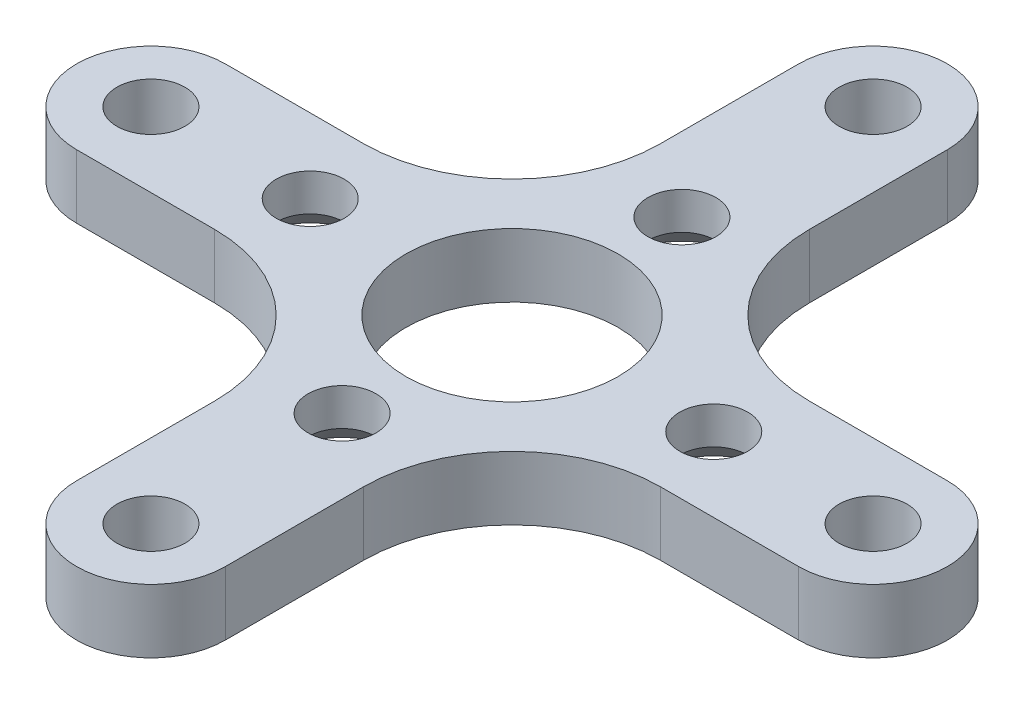
ISO-10303-21;
HEADER;
FILE_DESCRIPTION(('STEP AP214'),'2;1');
FILE_NAME('part.step','',(''),(''),'','','');
FILE_SCHEMA(('AUTOMOTIVE_DESIGN { 1 0 10303 214 1 1 1 1 }'));
ENDSEC;
DATA;
#1=APPLICATION_CONTEXT('core data for automotive mechanical design processes');
#2=APPLICATION_PROTOCOL_DEFINITION('international standard','automotive_design',2000,#1);
#3=PRODUCT_CONTEXT('',#1,'mechanical');
#4=PRODUCT('Part','Part','',(#3));
#5=PRODUCT_RELATED_PRODUCT_CATEGORY('part','',(#4));
#6=PRODUCT_DEFINITION_FORMATION('','',#4);
#7=PRODUCT_DEFINITION_CONTEXT('part definition',#1,'design');
#8=PRODUCT_DEFINITION('design','',#6,#7);
#9=PRODUCT_DEFINITION_SHAPE('','',#8);
#10=(LENGTH_UNIT() NAMED_UNIT(*) SI_UNIT(.MILLI.,.METRE.));
#11=(NAMED_UNIT(*) PLANE_ANGLE_UNIT() SI_UNIT($,.RADIAN.));
#12=(NAMED_UNIT(*) SI_UNIT($,.STERADIAN.) SOLID_ANGLE_UNIT());
#13=UNCERTAINTY_MEASURE_WITH_UNIT(LENGTH_MEASURE(1.E-05),#10,'distance_accuracy_value','');
#14=(GEOMETRIC_REPRESENTATION_CONTEXT(3) GLOBAL_UNCERTAINTY_ASSIGNED_CONTEXT((#13)) GLOBAL_UNIT_ASSIGNED_CONTEXT((#10,
#11,#12)) REPRESENTATION_CONTEXT('',''));
#15=CARTESIAN_POINT('',(0.,0.,0.));
#16=DIRECTION('',(0.,0.,1.));
#17=DIRECTION('',(1.,0.,0.));
#18=AXIS2_PLACEMENT_3D('',#15,#16,#17);
#19=CARTESIAN_POINT('',(0.,0.,0.));
#20=DIRECTION('',(0.,1.,0.));
#21=DIRECTION('',(0.,0.,1.));
#22=AXIS2_PLACEMENT_3D('',#19,#20,#21);
#23=PLANE('',#22);
#24=CARTESIAN_POINT('',(0.,0.,-8.));
#25=DIRECTION('',(0.,-1.,0.));
#26=DIRECTION('',(0.,0.,-1.));
#27=AXIS2_PLACEMENT_3D('',#24,#25,#26);
#28=CIRCLE('',#27,2.85);
#29=CARTESIAN_POINT('',(0.,0.,-10.85));
#30=VERTEX_POINT('',#29);
#31=EDGE_CURVE('E387',#30,#30,#28,.T.);
#32=ORIENTED_EDGE('',*,*,#31,.F.);
#33=EDGE_LOOP('',(#32));
#34=FACE_BOUND('',#33,.T.);
#35=CARTESIAN_POINT('',(-1.04509550507507E-13,0.,8.));
#36=DIRECTION('',(0.,-1.,0.));
#37=DIRECTION('',(0.,0.,-1.));
#38=AXIS2_PLACEMENT_3D('',#35,#36,#37);
#39=CIRCLE('',#38,2.85);
#40=CARTESIAN_POINT('',(-1.04509550507507E-13,0.,5.15));
#41=VERTEX_POINT('',#40);
#42=EDGE_CURVE('E394',#41,#41,#39,.T.);
#43=ORIENTED_EDGE('',*,*,#42,.F.);
#44=EDGE_LOOP('',(#43));
#45=FACE_BOUND('',#44,.T.);
#46=CARTESIAN_POINT('',(-9.5,0.,0.));
#47=DIRECTION('',(0.,-1.,0.));
#48=DIRECTION('',(0.,0.,-1.));
#49=AXIS2_PLACEMENT_3D('',#46,#47,#48);
#50=CIRCLE('',#49,2.85);
#51=CARTESIAN_POINT('',(-9.5,0.,-2.85));
#52=VERTEX_POINT('',#51);
#53=EDGE_CURVE('E403',#52,#52,#50,.T.);
#54=ORIENTED_EDGE('',*,*,#53,.F.);
#55=EDGE_LOOP('',(#54));
#56=FACE_BOUND('',#55,.T.);
#57=CARTESIAN_POINT('',(9.5,0.,0.));
#58=DIRECTION('',(0.,-1.,0.));
#59=DIRECTION('',(0.,0.,-1.));
#60=AXIS2_PLACEMENT_3D('',#57,#58,#59);
#61=CIRCLE('',#60,2.85);
#62=CARTESIAN_POINT('',(9.5,0.,-2.85));
#63=VERTEX_POINT('',#62);
#64=EDGE_CURVE('E412',#63,#63,#61,.T.);
#65=ORIENTED_EDGE('',*,*,#64,.F.);
#66=EDGE_LOOP('',(#65));
#67=FACE_BOUND('',#66,.T.);
#68=CARTESIAN_POINT('',(1.55067111884495E-13,0.,-17.));
#69=DIRECTION('',(0.,-1.,0.));
#70=DIRECTION('',(0.,0.,-1.));
#71=AXIS2_PLACEMENT_3D('',#68,#69,#70);
#72=CIRCLE('',#71,1.59999999999999);
#73=CARTESIAN_POINT('',(1.55067111884495E-13,0.,-18.6));
#74=VERTEX_POINT('',#73);
#75=EDGE_CURVE('E250',#74,#74,#72,.T.);
#76=ORIENTED_EDGE('',*,*,#75,.F.);
#77=EDGE_LOOP('',(#76));
#78=FACE_BOUND('',#77,.T.);
#79=CARTESIAN_POINT('',(-17.,0.,-2.14422294644828E-13));
#80=DIRECTION('',(0.,-1.,0.));
#81=DIRECTION('',(0.,0.,-1.));
#82=AXIS2_PLACEMENT_3D('',#79,#80,#81);
#83=CIRCLE('',#82,1.59999999999999);
#84=CARTESIAN_POINT('',(-17.,0.,-1.6000000000002));
#85=VERTEX_POINT('',#84);
#86=EDGE_CURVE('E249',#85,#85,#83,.T.);
#87=ORIENTED_EDGE('',*,*,#86,.F.);
#88=EDGE_LOOP('',(#87));
#89=FACE_BOUND('',#88,.T.);
#90=CARTESIAN_POINT('',(-1.55067111884495E-13,0.,17.));
#91=DIRECTION('',(0.,-1.,0.));
#92=DIRECTION('',(0.,0.,-1.));
#93=AXIS2_PLACEMENT_3D('',#90,#91,#92);
#94=CIRCLE('',#93,1.59999999999999);
#95=CARTESIAN_POINT('',(-1.55067111884495E-13,0.,15.4));
#96=VERTEX_POINT('',#95);
#97=EDGE_CURVE('E267',#96,#96,#94,.T.);
#98=ORIENTED_EDGE('',*,*,#97,.F.);
#99=EDGE_LOOP('',(#98));
#100=FACE_BOUND('',#99,.T.);
#101=DIRECTION('',(0.,0.,-1.));
#102=VECTOR('',#101,1.);
#103=CARTESIAN_POINT('',(-3.5,0.,0.));
#104=LINE('',#103,#102);
#105=CARTESIAN_POINT('',(-3.5,0.,17.));
#106=VERTEX_POINT('',#105);
#107=CARTESIAN_POINT('',(-3.5,0.,10.5));
#108=VERTEX_POINT('',#107);
#109=EDGE_CURVE('E178',#106,#108,#104,.T.);
#110=ORIENTED_EDGE('',*,*,#109,.T.);
#111=CARTESIAN_POINT('',(-10.5,0.,10.5));
#112=DIRECTION('',(0.,1.,0.));
#113=DIRECTION('',(0.,0.,1.));
#114=AXIS2_PLACEMENT_3D('',#111,#112,#113);
#115=CIRCLE('',#114,7.);
#116=CARTESIAN_POINT('',(-10.5,0.,3.5));
#117=VERTEX_POINT('',#116);
#118=EDGE_CURVE('E214',#108,#117,#115,.T.);
#119=ORIENTED_EDGE('',*,*,#118,.T.);
#120=DIRECTION('',(1.,0.,0.));
#121=VECTOR('',#120,1.);
#122=CARTESIAN_POINT('',(0.,0.,3.5));
#123=LINE('',#122,#121);
#124=CARTESIAN_POINT('',(-17.,0.,3.5));
#125=VERTEX_POINT('',#124);
#126=EDGE_CURVE('E212',#125,#117,#123,.T.);
#127=ORIENTED_EDGE('',*,*,#126,.F.);
#128=CARTESIAN_POINT('',(-17.,0.,0.));
#129=DIRECTION('',(0.,1.,0.));
#130=DIRECTION('',(0.,0.,1.));
#131=AXIS2_PLACEMENT_3D('',#128,#129,#130);
#132=CIRCLE('',#131,3.50000000000002);
#133=CARTESIAN_POINT('',(-17.,0.,-3.5));
#134=VERTEX_POINT('',#133);
#135=EDGE_CURVE('E167',#134,#125,#132,.T.);
#136=ORIENTED_EDGE('',*,*,#135,.F.);
#137=DIRECTION('',(1.,0.,0.));
#138=VECTOR('',#137,1.);
#139=CARTESIAN_POINT('',(0.,0.,-3.5));
#140=LINE('',#139,#138);
#141=CARTESIAN_POINT('',(-10.5,0.,-3.5));
#142=VERTEX_POINT('',#141);
#143=EDGE_CURVE('E208',#134,#142,#140,.T.);
#144=ORIENTED_EDGE('',*,*,#143,.T.);
#145=CARTESIAN_POINT('',(-10.5,0.,-10.5));
#146=DIRECTION('',(0.,1.,0.));
#147=DIRECTION('',(0.,0.,1.));
#148=AXIS2_PLACEMENT_3D('',#145,#146,#147);
#149=CIRCLE('',#148,7.);
#150=CARTESIAN_POINT('',(-3.5,0.,-10.5));
#151=VERTEX_POINT('',#150);
#152=EDGE_CURVE('E205',#151,#142,#149,.F.);
#153=ORIENTED_EDGE('',*,*,#152,.F.);
#154=DIRECTION('',(0.,0.,-1.));
#155=VECTOR('',#154,1.);
#156=CARTESIAN_POINT('',(-3.5,0.,0.));
#157=LINE('',#156,#155);
#158=CARTESIAN_POINT('',(-3.5,0.,-17.));
#159=VERTEX_POINT('',#158);
#160=EDGE_CURVE('E202',#151,#159,#157,.T.);
#161=ORIENTED_EDGE('',*,*,#160,.T.);
#162=CARTESIAN_POINT('',(0.,0.,-17.));
#163=DIRECTION('',(0.,1.,0.));
#164=DIRECTION('',(0.,0.,1.));
#165=AXIS2_PLACEMENT_3D('',#162,#163,#164);
#166=CIRCLE('',#165,3.50000000000002);
#167=CARTESIAN_POINT('',(3.5,0.,-17.));
#168=VERTEX_POINT('',#167);
#169=EDGE_CURVE('E199',#168,#159,#166,.T.);
#170=ORIENTED_EDGE('',*,*,#169,.F.);
#171=DIRECTION('',(0.,0.,-1.));
#172=VECTOR('',#171,1.);
#173=CARTESIAN_POINT('',(3.5,0.,0.));
#174=LINE('',#173,#172);
#175=CARTESIAN_POINT('',(3.5,0.,-10.5000000000001));
#176=VERTEX_POINT('',#175);
#177=EDGE_CURVE('E197',#176,#168,#174,.T.);
#178=ORIENTED_EDGE('',*,*,#177,.F.);
#179=CARTESIAN_POINT('',(10.5,0.,-10.5));
#180=DIRECTION('',(0.,1.,0.));
#181=DIRECTION('',(0.,0.,1.));
#182=AXIS2_PLACEMENT_3D('',#179,#180,#181);
#183=CIRCLE('',#182,7.);
#184=CARTESIAN_POINT('',(10.5000000000001,0.,-3.50000000000001));
#185=VERTEX_POINT('',#184);
#186=EDGE_CURVE('E195',#185,#176,#183,.F.);
#187=ORIENTED_EDGE('',*,*,#186,.F.);
#188=DIRECTION('',(1.,0.,0.));
#189=VECTOR('',#188,1.);
#190=CARTESIAN_POINT('',(0.,0.,-3.5));
#191=LINE('',#190,#189);
#192=CARTESIAN_POINT('',(17.,0.,-3.50000000000001));
#193=VERTEX_POINT('',#192);
#194=EDGE_CURVE('E192',#185,#193,#191,.T.);
#195=ORIENTED_EDGE('',*,*,#194,.T.);
#196=CARTESIAN_POINT('',(17.,0.,1.15587516182841E-13));
#197=DIRECTION('',(0.,1.,0.));
#198=DIRECTION('',(0.,0.,1.));
#199=AXIS2_PLACEMENT_3D('',#196,#197,#198);
#200=CIRCLE('',#199,3.50000000000002);
#201=CARTESIAN_POINT('',(17.,0.,3.49999999999999));
#202=VERTEX_POINT('',#201);
#203=EDGE_CURVE('E189',#202,#193,#200,.T.);
#204=ORIENTED_EDGE('',*,*,#203,.F.);
#205=DIRECTION('',(1.,0.,0.));
#206=VECTOR('',#205,1.);
#207=CARTESIAN_POINT('',(0.,0.,3.49999999999999));
#208=LINE('',#207,#206);
#209=CARTESIAN_POINT('',(10.5000000000001,0.,3.49999999999999));
#210=VERTEX_POINT('',#209);
#211=EDGE_CURVE('E187',#210,#202,#208,.T.);
#212=ORIENTED_EDGE('',*,*,#211,.F.);
#213=CARTESIAN_POINT('',(10.5,0.,10.5));
#214=DIRECTION('',(0.,1.,0.));
#215=DIRECTION('',(0.,0.,1.));
#216=AXIS2_PLACEMENT_3D('',#213,#214,#215);
#217=CIRCLE('',#216,7.);
#218=CARTESIAN_POINT('',(3.5,0.,10.5));
#219=VERTEX_POINT('',#218);
#220=EDGE_CURVE('E185',#219,#210,#217,.F.);
#221=ORIENTED_EDGE('',*,*,#220,.F.);
#222=DIRECTION('',(0.,0.,-1.));
#223=VECTOR('',#222,1.);
#224=CARTESIAN_POINT('',(3.50000000000001,0.,0.));
#225=LINE('',#224,#223);
#226=CARTESIAN_POINT('',(3.5,0.,17.));
#227=VERTEX_POINT('',#226);
#228=EDGE_CURVE('E183',#227,#219,#225,.T.);
#229=ORIENTED_EDGE('',*,*,#228,.F.);
#230=CARTESIAN_POINT('',(-1.74942698943174E-13,0.,17.));
#231=DIRECTION('',(0.,1.,0.));
#232=DIRECTION('',(0.,0.,1.));
#233=AXIS2_PLACEMENT_3D('',#230,#231,#232);
#234=CIRCLE('',#233,3.50000000000002);
#235=EDGE_CURVE('E180',#106,#227,#234,.T.);
#236=ORIENTED_EDGE('',*,*,#235,.F.);
#237=EDGE_LOOP('',(#110,#119,#127,#136,#144,#153,#161,#170,#178,#187,#195,#204,#212,#221,#229,#236));
#238=FACE_BOUND('',#237,.T.);
#239=CARTESIAN_POINT('',(0.,0.,0.));
#240=DIRECTION('',(0.,-1.,0.));
#241=DIRECTION('',(0.,0.,-1.));
#242=AXIS2_PLACEMENT_3D('',#239,#240,#241);
#243=CIRCLE('',#242,4.99999999999999);
#244=CARTESIAN_POINT('',(0.,0.,-4.99999999999999));
#245=VERTEX_POINT('',#244);
#246=EDGE_CURVE('E273',#245,#245,#243,.T.);
#247=ORIENTED_EDGE('',*,*,#246,.F.);
#248=EDGE_LOOP('',(#247));
#249=FACE_BOUND('',#248,.T.);
#250=CARTESIAN_POINT('',(17.,0.,3.33132660165494E-13));
#251=DIRECTION('',(0.,-1.,0.));
#252=DIRECTION('',(0.,0.,-1.));
#253=AXIS2_PLACEMENT_3D('',#250,#251,#252);
#254=CIRCLE('',#253,1.59999999999999);
#255=CARTESIAN_POINT('',(17.,0.,-1.59999999999966));
#256=VERTEX_POINT('',#255);
#257=EDGE_CURVE('E261',#256,#256,#254,.T.);
#258=ORIENTED_EDGE('',*,*,#257,.F.);
#259=EDGE_LOOP('',(#258));
#260=FACE_BOUND('',#259,.T.);
#261=ADVANCED_FACE('F34',(#34,#45,#56,#67,#78,#89,#100,#238,#249,#260),#23,.F.);
#262=CARTESIAN_POINT('',(-3.5,3.,0.));
#263=DIRECTION('',(-1.,0.,0.));
#264=DIRECTION('',(0.,0.,1.));
#265=AXIS2_PLACEMENT_3D('',#262,#263,#264);
#266=PLANE('',#265);
#267=ORIENTED_EDGE('',*,*,#109,.F.);
#268=DIRECTION('',(0.,-1.,0.));
#269=VECTOR('',#268,1.);
#270=CARTESIAN_POINT('',(-3.5,3.,17.));
#271=LINE('',#270,#269);
#272=CARTESIAN_POINT('',(-3.5,3.,17.));
#273=VERTEX_POINT('',#272);
#274=EDGE_CURVE('E11',#273,#106,#271,.T.);
#275=ORIENTED_EDGE('',*,*,#274,.F.);
#276=DIRECTION('',(0.,0.,-1.));
#277=VECTOR('',#276,1.);
#278=CARTESIAN_POINT('',(-3.5,3.,0.));
#279=LINE('',#278,#277);
#280=CARTESIAN_POINT('',(-3.5,3.,10.5));
#281=VERTEX_POINT('',#280);
#282=EDGE_CURVE('E217',#273,#281,#279,.T.);
#283=ORIENTED_EDGE('',*,*,#282,.T.);
#284=DIRECTION('',(0.,-1.,0.));
#285=VECTOR('',#284,1.);
#286=CARTESIAN_POINT('',(-3.5,3.,10.5));
#287=LINE('',#286,#285);
#288=EDGE_CURVE('E53',#281,#108,#287,.T.);
#289=ORIENTED_EDGE('',*,*,#288,.T.);
#290=EDGE_LOOP('',(#267,#275,#283,#289));
#291=FACE_BOUND('',#290,.T.);
#292=ADVANCED_FACE('F36',(#291),#266,.T.);
#293=CARTESIAN_POINT('',(-1.74942698943174E-13,3.,17.));
#294=DIRECTION('',(0.,-1.,0.));
#295=DIRECTION('',(0.,0.,-1.));
#296=AXIS2_PLACEMENT_3D('',#293,#294,#295);
#297=CYLINDRICAL_SURFACE('',#296,3.50000000000002);
#298=ORIENTED_EDGE('',*,*,#235,.T.);
#299=DIRECTION('',(0.,-1.,0.));
#300=VECTOR('',#299,1.);
#301=CARTESIAN_POINT('',(3.5,3.,17.));
#302=LINE('',#301,#300);
#303=CARTESIAN_POINT('',(3.5,3.,17.));
#304=VERTEX_POINT('',#303);
#305=EDGE_CURVE('E44',#304,#227,#302,.T.);
#306=ORIENTED_EDGE('',*,*,#305,.F.);
#307=CARTESIAN_POINT('',(-1.74942698943174E-13,3.,17.));
#308=DIRECTION('',(0.,1.,0.));
#309=DIRECTION('',(0.,0.,1.));
#310=AXIS2_PLACEMENT_3D('',#307,#308,#309);
#311=CIRCLE('',#310,3.50000000000002);
#312=EDGE_CURVE('E279',#273,#304,#311,.T.);
#313=ORIENTED_EDGE('',*,*,#312,.F.);
#314=ORIENTED_EDGE('',*,*,#274,.T.);
#315=EDGE_LOOP('',(#298,#306,#313,#314));
#316=FACE_BOUND('',#315,.T.);
#317=ADVANCED_FACE('F327',(#316),#297,.T.);
#318=CARTESIAN_POINT('',(3.50000000000001,3.,0.));
#319=DIRECTION('',(-1.,0.,0.));
#320=DIRECTION('',(0.,0.,1.));
#321=AXIS2_PLACEMENT_3D('',#318,#319,#320);
#322=PLANE('',#321);
#323=ORIENTED_EDGE('',*,*,#228,.T.);
#324=DIRECTION('',(0.,-1.,0.));
#325=VECTOR('',#324,1.);
#326=CARTESIAN_POINT('',(3.5,3.,10.5));
#327=LINE('',#326,#325);
#328=CARTESIAN_POINT('',(3.5,3.,10.5));
#329=VERTEX_POINT('',#328);
#330=EDGE_CURVE('E243',#329,#219,#327,.T.);
#331=ORIENTED_EDGE('',*,*,#330,.F.);
#332=DIRECTION('',(0.,0.,-1.));
#333=VECTOR('',#332,1.);
#334=CARTESIAN_POINT('',(3.50000000000001,3.,0.));
#335=LINE('',#334,#333);
#336=EDGE_CURVE('E281',#304,#329,#335,.T.);
#337=ORIENTED_EDGE('',*,*,#336,.F.);
#338=ORIENTED_EDGE('',*,*,#305,.T.);
#339=EDGE_LOOP('',(#323,#331,#337,#338));
#340=FACE_BOUND('',#339,.T.);
#341=ADVANCED_FACE('F651',(#340),#322,.F.);
#342=CARTESIAN_POINT('',(10.5,3.,10.5));
#343=DIRECTION('',(0.,-1.,0.));
#344=DIRECTION('',(0.,0.,-1.));
#345=AXIS2_PLACEMENT_3D('',#342,#343,#344);
#346=CYLINDRICAL_SURFACE('',#345,7.);
#347=ORIENTED_EDGE('',*,*,#220,.T.);
#348=DIRECTION('',(0.,-1.,0.));
#349=VECTOR('',#348,1.);
#350=CARTESIAN_POINT('',(10.5000000000001,3.,3.49999999999999));
#351=LINE('',#350,#349);
#352=CARTESIAN_POINT('',(10.5000000000001,3.,3.49999999999999));
#353=VERTEX_POINT('',#352);
#354=EDGE_CURVE('E240',#353,#210,#351,.T.);
#355=ORIENTED_EDGE('',*,*,#354,.F.);
#356=CARTESIAN_POINT('',(10.5,3.,10.5));
#357=DIRECTION('',(0.,1.,0.));
#358=DIRECTION('',(0.,0.,1.));
#359=AXIS2_PLACEMENT_3D('',#356,#357,#358);
#360=CIRCLE('',#359,7.);
#361=EDGE_CURVE('E283',#329,#353,#360,.F.);
#362=ORIENTED_EDGE('',*,*,#361,.F.);
#363=ORIENTED_EDGE('',*,*,#330,.T.);
#364=EDGE_LOOP('',(#347,#355,#362,#363));
#365=FACE_BOUND('',#364,.T.);
#366=ADVANCED_FACE('F642',(#365),#346,.F.);
#367=CARTESIAN_POINT('',(0.,3.,3.49999999999999));
#368=DIRECTION('',(0.,0.,-1.));
#369=DIRECTION('',(-1.,0.,0.));
#370=AXIS2_PLACEMENT_3D('',#367,#368,#369);
#371=PLANE('',#370);
#372=ORIENTED_EDGE('',*,*,#211,.T.);
#373=DIRECTION('',(0.,-1.,0.));
#374=VECTOR('',#373,1.);
#375=CARTESIAN_POINT('',(17.,3.,3.49999999999999));
#376=LINE('',#375,#374);
#377=CARTESIAN_POINT('',(17.,3.,3.49999999999999));
#378=VERTEX_POINT('',#377);
#379=EDGE_CURVE('E237',#378,#202,#376,.T.);
#380=ORIENTED_EDGE('',*,*,#379,.F.);
#381=DIRECTION('',(1.,0.,0.));
#382=VECTOR('',#381,1.);
#383=CARTESIAN_POINT('',(0.,3.,3.49999999999999));
#384=LINE('',#383,#382);
#385=EDGE_CURVE('E285',#353,#378,#384,.T.);
#386=ORIENTED_EDGE('',*,*,#385,.F.);
#387=ORIENTED_EDGE('',*,*,#354,.T.);
#388=EDGE_LOOP('',(#372,#380,#386,#387));
#389=FACE_BOUND('',#388,.T.);
#390=ADVANCED_FACE('F633',(#389),#371,.F.);
#391=CARTESIAN_POINT('',(17.,3.,1.15587516182841E-13));
#392=DIRECTION('',(0.,-1.,0.));
#393=DIRECTION('',(0.,0.,-1.));
#394=AXIS2_PLACEMENT_3D('',#391,#392,#393);
#395=CYLINDRICAL_SURFACE('',#394,3.50000000000002);
#396=ORIENTED_EDGE('',*,*,#203,.T.);
#397=DIRECTION('',(0.,-1.,0.));
#398=VECTOR('',#397,1.);
#399=CARTESIAN_POINT('',(17.,3.,-3.50000000000001));
#400=LINE('',#399,#398);
#401=CARTESIAN_POINT('',(17.,3.,-3.50000000000001));
#402=VERTEX_POINT('',#401);
#403=EDGE_CURVE('E235',#402,#193,#400,.T.);
#404=ORIENTED_EDGE('',*,*,#403,.F.);
#405=CARTESIAN_POINT('',(17.,3.,1.15587516182841E-13));
#406=DIRECTION('',(0.,1.,0.));
#407=DIRECTION('',(0.,0.,1.));
#408=AXIS2_PLACEMENT_3D('',#405,#406,#407);
#409=CIRCLE('',#408,3.50000000000002);
#410=EDGE_CURVE('E287',#378,#402,#409,.T.);
#411=ORIENTED_EDGE('',*,*,#410,.F.);
#412=ORIENTED_EDGE('',*,*,#379,.T.);
#413=EDGE_LOOP('',(#396,#404,#411,#412));
#414=FACE_BOUND('',#413,.T.);
#415=ADVANCED_FACE('F624',(#414),#395,.T.);
#416=CARTESIAN_POINT('',(0.,3.,-3.5));
#417=DIRECTION('',(0.,0.,-1.));
#418=DIRECTION('',(-1.,0.,0.));
#419=AXIS2_PLACEMENT_3D('',#416,#417,#418);
#420=PLANE('',#419);
#421=ORIENTED_EDGE('',*,*,#194,.F.);
#422=DIRECTION('',(0.,-1.,0.));
#423=VECTOR('',#422,1.);
#424=CARTESIAN_POINT('',(10.5000000000001,3.,-3.50000000000001));
#425=LINE('',#424,#423);
#426=CARTESIAN_POINT('',(10.5000000000001,3.,-3.50000000000001));
#427=VERTEX_POINT('',#426);
#428=EDGE_CURVE('E233',#427,#185,#425,.T.);
#429=ORIENTED_EDGE('',*,*,#428,.F.);
#430=DIRECTION('',(1.,0.,0.));
#431=VECTOR('',#430,1.);
#432=CARTESIAN_POINT('',(0.,3.,-3.5));
#433=LINE('',#432,#431);
#434=EDGE_CURVE('E289',#427,#402,#433,.T.);
#435=ORIENTED_EDGE('',*,*,#434,.T.);
#436=ORIENTED_EDGE('',*,*,#403,.T.);
#437=EDGE_LOOP('',(#421,#429,#435,#436));
#438=FACE_BOUND('',#437,.T.);
#439=ADVANCED_FACE('F615',(#438),#420,.T.);
#440=CARTESIAN_POINT('',(10.5,3.,-10.5));
#441=DIRECTION('',(0.,-1.,0.));
#442=DIRECTION('',(0.,0.,-1.));
#443=AXIS2_PLACEMENT_3D('',#440,#441,#442);
#444=CYLINDRICAL_SURFACE('',#443,7.);
#445=ORIENTED_EDGE('',*,*,#186,.T.);
#446=DIRECTION('',(0.,-1.,0.));
#447=VECTOR('',#446,1.);
#448=CARTESIAN_POINT('',(3.5,3.,-10.5000000000001));
#449=LINE('',#448,#447);
#450=CARTESIAN_POINT('',(3.5,3.,-10.5000000000001));
#451=VERTEX_POINT('',#450);
#452=EDGE_CURVE('E230',#451,#176,#449,.T.);
#453=ORIENTED_EDGE('',*,*,#452,.F.);
#454=CARTESIAN_POINT('',(10.5,3.,-10.5));
#455=DIRECTION('',(0.,1.,0.));
#456=DIRECTION('',(0.,0.,1.));
#457=AXIS2_PLACEMENT_3D('',#454,#455,#456);
#458=CIRCLE('',#457,7.);
#459=EDGE_CURVE('E292',#427,#451,#458,.F.);
#460=ORIENTED_EDGE('',*,*,#459,.F.);
#461=ORIENTED_EDGE('',*,*,#428,.T.);
#462=EDGE_LOOP('',(#445,#453,#460,#461));
#463=FACE_BOUND('',#462,.T.);
#464=ADVANCED_FACE('F606',(#463),#444,.F.);
#465=CARTESIAN_POINT('',(3.5,3.,0.));
#466=DIRECTION('',(-1.,0.,0.));
#467=DIRECTION('',(0.,0.,1.));
#468=AXIS2_PLACEMENT_3D('',#465,#466,#467);
#469=PLANE('',#468);
#470=ORIENTED_EDGE('',*,*,#177,.T.);
#471=DIRECTION('',(0.,-1.,0.));
#472=VECTOR('',#471,1.);
#473=CARTESIAN_POINT('',(3.5,3.,-17.));
#474=LINE('',#473,#472);
#475=CARTESIAN_POINT('',(3.5,3.,-17.));
#476=VERTEX_POINT('',#475);
#477=EDGE_CURVE('E227',#476,#168,#474,.T.);
#478=ORIENTED_EDGE('',*,*,#477,.F.);
#479=DIRECTION('',(0.,0.,-1.));
#480=VECTOR('',#479,1.);
#481=CARTESIAN_POINT('',(3.5,3.,0.));
#482=LINE('',#481,#480);
#483=EDGE_CURVE('E294',#451,#476,#482,.T.);
#484=ORIENTED_EDGE('',*,*,#483,.F.);
#485=ORIENTED_EDGE('',*,*,#452,.T.);
#486=EDGE_LOOP('',(#470,#478,#484,#485));
#487=FACE_BOUND('',#486,.T.);
#488=ADVANCED_FACE('F597',(#487),#469,.F.);
#489=CARTESIAN_POINT('',(0.,3.,-17.));
#490=DIRECTION('',(0.,-1.,0.));
#491=DIRECTION('',(0.,0.,-1.));
#492=AXIS2_PLACEMENT_3D('',#489,#490,#491);
#493=CYLINDRICAL_SURFACE('',#492,3.50000000000002);
#494=ORIENTED_EDGE('',*,*,#169,.T.);
#495=DIRECTION('',(0.,-1.,0.));
#496=VECTOR('',#495,1.);
#497=CARTESIAN_POINT('',(-3.5,3.,-17.));
#498=LINE('',#497,#496);
#499=CARTESIAN_POINT('',(-3.5,3.,-17.));
#500=VERTEX_POINT('',#499);
#501=EDGE_CURVE('E225',#500,#159,#498,.T.);
#502=ORIENTED_EDGE('',*,*,#501,.F.);
#503=CARTESIAN_POINT('',(0.,3.,-17.));
#504=DIRECTION('',(0.,1.,0.));
#505=DIRECTION('',(0.,0.,1.));
#506=AXIS2_PLACEMENT_3D('',#503,#504,#505);
#507=CIRCLE('',#506,3.50000000000002);
#508=EDGE_CURVE('E296',#476,#500,#507,.T.);
#509=ORIENTED_EDGE('',*,*,#508,.F.);
#510=ORIENTED_EDGE('',*,*,#477,.T.);
#511=EDGE_LOOP('',(#494,#502,#509,#510));
#512=FACE_BOUND('',#511,.T.);
#513=ADVANCED_FACE('F588',(#512),#493,.T.);
#514=CARTESIAN_POINT('',(-3.5,3.,0.));
#515=DIRECTION('',(-1.,0.,0.));
#516=DIRECTION('',(0.,0.,1.));
#517=AXIS2_PLACEMENT_3D('',#514,#515,#516);
#518=PLANE('',#517);
#519=ORIENTED_EDGE('',*,*,#160,.F.);
#520=DIRECTION('',(0.,-1.,0.));
#521=VECTOR('',#520,1.);
#522=CARTESIAN_POINT('',(-3.5,3.,-10.5));
#523=LINE('',#522,#521);
#524=CARTESIAN_POINT('',(-3.5,3.,-10.5));
#525=VERTEX_POINT('',#524);
#526=EDGE_CURVE('E223',#525,#151,#523,.T.);
#527=ORIENTED_EDGE('',*,*,#526,.F.);
#528=DIRECTION('',(0.,0.,-1.));
#529=VECTOR('',#528,1.);
#530=CARTESIAN_POINT('',(-3.5,3.,0.));
#531=LINE('',#530,#529);
#532=EDGE_CURVE('E298',#525,#500,#531,.T.);
#533=ORIENTED_EDGE('',*,*,#532,.T.);
#534=ORIENTED_EDGE('',*,*,#501,.T.);
#535=EDGE_LOOP('',(#519,#527,#533,#534));
#536=FACE_BOUND('',#535,.T.);
#537=ADVANCED_FACE('F579',(#536),#518,.T.);
#538=CARTESIAN_POINT('',(-10.5,3.,-10.5));
#539=DIRECTION('',(0.,-1.,0.));
#540=DIRECTION('',(0.,0.,-1.));
#541=AXIS2_PLACEMENT_3D('',#538,#539,#540);
#542=CYLINDRICAL_SURFACE('',#541,7.);
#543=ORIENTED_EDGE('',*,*,#152,.T.);
#544=DIRECTION('',(0.,-1.,0.));
#545=VECTOR('',#544,1.);
#546=CARTESIAN_POINT('',(-10.5,3.,-3.5));
#547=LINE('',#546,#545);
#548=CARTESIAN_POINT('',(-10.5,3.,-3.5));
#549=VERTEX_POINT('',#548);
#550=EDGE_CURVE('E221',#549,#142,#547,.T.);
#551=ORIENTED_EDGE('',*,*,#550,.F.);
#552=CARTESIAN_POINT('',(-10.5,3.,-10.5));
#553=DIRECTION('',(0.,1.,0.));
#554=DIRECTION('',(0.,0.,1.));
#555=AXIS2_PLACEMENT_3D('',#552,#553,#554);
#556=CIRCLE('',#555,7.);
#557=EDGE_CURVE('E301',#525,#549,#556,.F.);
#558=ORIENTED_EDGE('',*,*,#557,.F.);
#559=ORIENTED_EDGE('',*,*,#526,.T.);
#560=EDGE_LOOP('',(#543,#551,#558,#559));
#561=FACE_BOUND('',#560,.T.);
#562=ADVANCED_FACE('F571',(#561),#542,.F.);
#563=CARTESIAN_POINT('',(0.,3.,-3.5));
#564=DIRECTION('',(0.,0.,-1.));
#565=DIRECTION('',(-1.,0.,0.));
#566=AXIS2_PLACEMENT_3D('',#563,#564,#565);
#567=PLANE('',#566);
#568=ORIENTED_EDGE('',*,*,#143,.F.);
#569=DIRECTION('',(0.,-1.,0.));
#570=VECTOR('',#569,1.);
#571=CARTESIAN_POINT('',(-17.,3.,-3.5));
#572=LINE('',#571,#570);
#573=CARTESIAN_POINT('',(-17.,3.,-3.5));
#574=VERTEX_POINT('',#573);
#575=EDGE_CURVE('E170',#574,#134,#572,.T.);
#576=ORIENTED_EDGE('',*,*,#575,.F.);
#577=DIRECTION('',(1.,0.,0.));
#578=VECTOR('',#577,1.);
#579=CARTESIAN_POINT('',(0.,3.,-3.5));
#580=LINE('',#579,#578);
#581=EDGE_CURVE('E160',#574,#549,#580,.T.);
#582=ORIENTED_EDGE('',*,*,#581,.T.);
#583=ORIENTED_EDGE('',*,*,#550,.T.);
#584=EDGE_LOOP('',(#568,#576,#582,#583));
#585=FACE_BOUND('',#584,.T.);
#586=ADVANCED_FACE('F304',(#585),#567,.T.);
#587=CARTESIAN_POINT('',(-17.,3.,0.));
#588=DIRECTION('',(0.,-1.,0.));
#589=DIRECTION('',(0.,0.,-1.));
#590=AXIS2_PLACEMENT_3D('',#587,#588,#589);
#591=CYLINDRICAL_SURFACE('',#590,3.50000000000002);
#592=ORIENTED_EDGE('',*,*,#135,.T.);
#593=DIRECTION('',(0.,-1.,0.));
#594=VECTOR('',#593,1.);
#595=CARTESIAN_POINT('',(-17.,3.,3.5));
#596=LINE('',#595,#594);
#597=CARTESIAN_POINT('',(-17.,3.,3.5));
#598=VERTEX_POINT('',#597);
#599=EDGE_CURVE('E164',#598,#125,#596,.T.);
#600=ORIENTED_EDGE('',*,*,#599,.F.);
#601=CARTESIAN_POINT('',(-17.,3.,0.));
#602=DIRECTION('',(0.,1.,0.));
#603=DIRECTION('',(0.,0.,1.));
#604=AXIS2_PLACEMENT_3D('',#601,#602,#603);
#605=CIRCLE('',#604,3.50000000000002);
#606=EDGE_CURVE('E152',#574,#598,#605,.T.);
#607=ORIENTED_EDGE('',*,*,#606,.F.);
#608=ORIENTED_EDGE('',*,*,#575,.T.);
#609=EDGE_LOOP('',(#592,#600,#607,#608));
#610=FACE_BOUND('',#609,.T.);
#611=ADVANCED_FACE('F165',(#610),#591,.T.);
#612=CARTESIAN_POINT('',(0.,3.,3.5));
#613=DIRECTION('',(0.,0.,-1.));
#614=DIRECTION('',(-1.,0.,0.));
#615=AXIS2_PLACEMENT_3D('',#612,#613,#614);
#616=PLANE('',#615);
#617=ORIENTED_EDGE('',*,*,#126,.T.);
#618=DIRECTION('',(0.,-1.,0.));
#619=VECTOR('',#618,1.);
#620=CARTESIAN_POINT('',(-10.5,3.,3.5));
#621=LINE('',#620,#619);
#622=CARTESIAN_POINT('',(-10.5,3.,3.5));
#623=VERTEX_POINT('',#622);
#624=EDGE_CURVE('E103',#623,#117,#621,.T.);
#625=ORIENTED_EDGE('',*,*,#624,.F.);
#626=DIRECTION('',(1.,0.,0.));
#627=VECTOR('',#626,1.);
#628=CARTESIAN_POINT('',(0.,3.,3.5));
#629=LINE('',#628,#627);
#630=EDGE_CURVE('E158',#598,#623,#629,.T.);
#631=ORIENTED_EDGE('',*,*,#630,.F.);
#632=ORIENTED_EDGE('',*,*,#599,.T.);
#633=EDGE_LOOP('',(#617,#625,#631,#632));
#634=FACE_BOUND('',#633,.T.);
#635=ADVANCED_FACE('F172',(#634),#616,.F.);
#636=CARTESIAN_POINT('',(-10.5,3.,10.5));
#637=DIRECTION('',(0.,-1.,0.));
#638=DIRECTION('',(0.,0.,-1.));
#639=AXIS2_PLACEMENT_3D('',#636,#637,#638);
#640=CYLINDRICAL_SURFACE('',#639,7.);
#641=ORIENTED_EDGE('',*,*,#118,.F.);
#642=ORIENTED_EDGE('',*,*,#288,.F.);
#643=CARTESIAN_POINT('',(-10.5,3.,10.5));
#644=DIRECTION('',(0.,1.,0.));
#645=DIRECTION('',(0.,0.,1.));
#646=AXIS2_PLACEMENT_3D('',#643,#644,#645);
#647=CIRCLE('',#646,7.);
#648=EDGE_CURVE('E173',#281,#623,#647,.T.);
#649=ORIENTED_EDGE('',*,*,#648,.T.);
#650=ORIENTED_EDGE('',*,*,#624,.T.);
#651=EDGE_LOOP('',(#641,#642,#649,#650));
#652=FACE_BOUND('',#651,.T.);
#653=ADVANCED_FACE('F310',(#652),#640,.F.);
#654=CARTESIAN_POINT('',(0.,3.,0.));
#655=DIRECTION('',(0.,1.,0.));
#656=DIRECTION('',(0.,0.,1.));
#657=AXIS2_PLACEMENT_3D('',#654,#655,#656);
#658=PLANE('',#657);
#659=CARTESIAN_POINT('',(0.,3.,-8.));
#660=DIRECTION('',(0.,-1.,0.));
#661=DIRECTION('',(0.,0.,-1.));
#662=AXIS2_PLACEMENT_3D('',#659,#660,#661);
#663=CIRCLE('',#662,1.6);
#664=CARTESIAN_POINT('',(0.,3.,-9.6));
#665=VERTEX_POINT('',#664);
#666=EDGE_CURVE('E389',#665,#665,#663,.T.);
#667=ORIENTED_EDGE('',*,*,#666,.T.);
#668=EDGE_LOOP('',(#667));
#669=FACE_BOUND('',#668,.T.);
#670=CARTESIAN_POINT('',(-1.04509550507507E-13,3.,8.));
#671=DIRECTION('',(0.,-1.,0.));
#672=DIRECTION('',(0.,0.,-1.));
#673=AXIS2_PLACEMENT_3D('',#670,#671,#672);
#674=CIRCLE('',#673,1.6);
#675=CARTESIAN_POINT('',(-1.04509550507507E-13,3.,6.4));
#676=VERTEX_POINT('',#675);
#677=EDGE_CURVE('E400',#676,#676,#674,.T.);
#678=ORIENTED_EDGE('',*,*,#677,.T.);
#679=EDGE_LOOP('',(#678));
#680=FACE_BOUND('',#679,.T.);
#681=CARTESIAN_POINT('',(-9.5,3.,0.));
#682=DIRECTION('',(0.,-1.,0.));
#683=DIRECTION('',(0.,0.,-1.));
#684=AXIS2_PLACEMENT_3D('',#681,#682,#683);
#685=CIRCLE('',#684,1.6);
#686=CARTESIAN_POINT('',(-9.5,3.,-1.6));
#687=VERTEX_POINT('',#686);
#688=EDGE_CURVE('E409',#687,#687,#685,.T.);
#689=ORIENTED_EDGE('',*,*,#688,.T.);
#690=EDGE_LOOP('',(#689));
#691=FACE_BOUND('',#690,.T.);
#692=CARTESIAN_POINT('',(9.5,3.,0.));
#693=DIRECTION('',(0.,-1.,0.));
#694=DIRECTION('',(0.,0.,-1.));
#695=AXIS2_PLACEMENT_3D('',#692,#693,#694);
#696=CIRCLE('',#695,1.6);
#697=CARTESIAN_POINT('',(9.5,3.,-1.6));
#698=VERTEX_POINT('',#697);
#699=EDGE_CURVE('E417',#698,#698,#696,.T.);
#700=ORIENTED_EDGE('',*,*,#699,.T.);
#701=EDGE_LOOP('',(#700));
#702=FACE_BOUND('',#701,.T.);
#703=CARTESIAN_POINT('',(17.,3.,3.33132660165494E-13));
#704=DIRECTION('',(0.,1.,0.));
#705=DIRECTION('',(0.,0.,1.));
#706=AXIS2_PLACEMENT_3D('',#703,#704,#705);
#707=CIRCLE('',#706,1.59999999999999);
#708=CARTESIAN_POINT('',(17.,3.,1.60000000000032));
#709=VERTEX_POINT('',#708);
#710=EDGE_CURVE('E38',#709,#709,#707,.T.);
#711=ORIENTED_EDGE('',*,*,#710,.F.);
#712=EDGE_LOOP('',(#711));
#713=FACE_BOUND('',#712,.T.);
#714=CARTESIAN_POINT('',(1.55067111884495E-13,3.,-17.));
#715=DIRECTION('',(0.,1.,0.));
#716=DIRECTION('',(0.,0.,1.));
#717=AXIS2_PLACEMENT_3D('',#714,#715,#716);
#718=CIRCLE('',#717,1.59999999999999);
#719=CARTESIAN_POINT('',(1.55067111884495E-13,3.,-15.4));
#720=VERTEX_POINT('',#719);
#721=EDGE_CURVE('E247',#720,#720,#718,.T.);
#722=ORIENTED_EDGE('',*,*,#721,.F.);
#723=EDGE_LOOP('',(#722));
#724=FACE_BOUND('',#723,.T.);
#725=CARTESIAN_POINT('',(-17.,3.,-2.14422294644828E-13));
#726=DIRECTION('',(0.,1.,0.));
#727=DIRECTION('',(0.,0.,1.));
#728=AXIS2_PLACEMENT_3D('',#725,#726,#727);
#729=CIRCLE('',#728,1.59999999999999);
#730=CARTESIAN_POINT('',(-17.,3.,1.59999999999977));
#731=VERTEX_POINT('',#730);
#732=EDGE_CURVE('E254',#731,#731,#729,.T.);
#733=ORIENTED_EDGE('',*,*,#732,.F.);
#734=EDGE_LOOP('',(#733));
#735=FACE_BOUND('',#734,.T.);
#736=CARTESIAN_POINT('',(-1.55067111884495E-13,3.,17.));
#737=DIRECTION('',(0.,1.,0.));
#738=DIRECTION('',(0.,0.,1.));
#739=AXIS2_PLACEMENT_3D('',#736,#737,#738);
#740=CIRCLE('',#739,1.59999999999999);
#741=CARTESIAN_POINT('',(-1.55067111884495E-13,3.,18.6));
#742=VERTEX_POINT('',#741);
#743=EDGE_CURVE('E270',#742,#742,#740,.T.);
#744=ORIENTED_EDGE('',*,*,#743,.F.);
#745=EDGE_LOOP('',(#744));
#746=FACE_BOUND('',#745,.T.);
#747=CARTESIAN_POINT('',(0.,3.,0.));
#748=DIRECTION('',(0.,1.,0.));
#749=DIRECTION('',(0.,0.,1.));
#750=AXIS2_PLACEMENT_3D('',#747,#748,#749);
#751=CIRCLE('',#750,4.99999999999999);
#752=CARTESIAN_POINT('',(0.,3.,4.99999999999999));
#753=VERTEX_POINT('',#752);
#754=EDGE_CURVE('E181',#753,#753,#751,.T.);
#755=ORIENTED_EDGE('',*,*,#754,.F.);
#756=EDGE_LOOP('',(#755));
#757=FACE_BOUND('',#756,.T.);
#758=ORIENTED_EDGE('',*,*,#282,.F.);
#759=ORIENTED_EDGE('',*,*,#312,.T.);
#760=ORIENTED_EDGE('',*,*,#336,.T.);
#761=ORIENTED_EDGE('',*,*,#361,.T.);
#762=ORIENTED_EDGE('',*,*,#385,.T.);
#763=ORIENTED_EDGE('',*,*,#410,.T.);
#764=ORIENTED_EDGE('',*,*,#434,.F.);
#765=ORIENTED_EDGE('',*,*,#459,.T.);
#766=ORIENTED_EDGE('',*,*,#483,.T.);
#767=ORIENTED_EDGE('',*,*,#508,.T.);
#768=ORIENTED_EDGE('',*,*,#532,.F.);
#769=ORIENTED_EDGE('',*,*,#557,.T.);
#770=ORIENTED_EDGE('',*,*,#581,.F.);
#771=ORIENTED_EDGE('',*,*,#606,.T.);
#772=ORIENTED_EDGE('',*,*,#630,.T.);
#773=ORIENTED_EDGE('',*,*,#648,.F.);
#774=EDGE_LOOP('',(#758,#759,#760,#761,#762,#763,#764,#765,#766,#767,#768,#769,#770,#771,#772,#773));
#775=FACE_BOUND('',#774,.T.);
#776=ADVANCED_FACE('F155',(#669,#680,#691,#702,#713,#724,#735,#746,#757,#775),#658,.T.);
#777=CARTESIAN_POINT('',(0.,0.,0.));
#778=DIRECTION('',(0.,-1.,0.));
#779=DIRECTION('',(0.,0.,-1.));
#780=AXIS2_PLACEMENT_3D('',#777,#778,#779);
#781=CYLINDRICAL_SURFACE('',#780,4.99999999999999);
#782=ORIENTED_EDGE('',*,*,#754,.T.);
#783=EDGE_LOOP('',(#782));
#784=FACE_BOUND('',#783,.T.);
#785=ORIENTED_EDGE('',*,*,#246,.T.);
#786=EDGE_LOOP('',(#785));
#787=FACE_BOUND('',#786,.T.);
#788=ADVANCED_FACE('F317',(#784,#787),#781,.F.);
#789=CARTESIAN_POINT('',(-1.55067111884495E-13,0.,17.));
#790=DIRECTION('',(0.,-1.,0.));
#791=DIRECTION('',(0.,0.,-1.));
#792=AXIS2_PLACEMENT_3D('',#789,#790,#791);
#793=CYLINDRICAL_SURFACE('',#792,1.59999999999999);
#794=ORIENTED_EDGE('',*,*,#743,.T.);
#795=EDGE_LOOP('',(#794));
#796=FACE_BOUND('',#795,.T.);
#797=ORIENTED_EDGE('',*,*,#97,.T.);
#798=EDGE_LOOP('',(#797));
#799=FACE_BOUND('',#798,.T.);
#800=ADVANCED_FACE('F333',(#796,#799),#793,.F.);
#801=CARTESIAN_POINT('',(-17.,0.,-2.14422294644828E-13));
#802=DIRECTION('',(0.,-1.,0.));
#803=DIRECTION('',(0.,0.,-1.));
#804=AXIS2_PLACEMENT_3D('',#801,#802,#803);
#805=CYLINDRICAL_SURFACE('',#804,1.59999999999999);
#806=ORIENTED_EDGE('',*,*,#732,.T.);
#807=EDGE_LOOP('',(#806));
#808=FACE_BOUND('',#807,.T.);
#809=ORIENTED_EDGE('',*,*,#86,.T.);
#810=EDGE_LOOP('',(#809));
#811=FACE_BOUND('',#810,.T.);
#812=ADVANCED_FACE('F337',(#808,#811),#805,.F.);
#813=CARTESIAN_POINT('',(1.55067111884495E-13,0.,-17.));
#814=DIRECTION('',(0.,-1.,0.));
#815=DIRECTION('',(0.,0.,-1.));
#816=AXIS2_PLACEMENT_3D('',#813,#814,#815);
#817=CYLINDRICAL_SURFACE('',#816,1.59999999999999);
#818=ORIENTED_EDGE('',*,*,#721,.T.);
#819=EDGE_LOOP('',(#818));
#820=FACE_BOUND('',#819,.T.);
#821=ORIENTED_EDGE('',*,*,#75,.T.);
#822=EDGE_LOOP('',(#821));
#823=FACE_BOUND('',#822,.T.);
#824=ADVANCED_FACE('F341',(#820,#823),#817,.F.);
#825=CARTESIAN_POINT('',(17.,0.,3.33132660165494E-13));
#826=DIRECTION('',(0.,-1.,0.));
#827=DIRECTION('',(0.,0.,-1.));
#828=AXIS2_PLACEMENT_3D('',#825,#826,#827);
#829=CYLINDRICAL_SURFACE('',#828,1.59999999999999);
#830=ORIENTED_EDGE('',*,*,#710,.T.);
#831=EDGE_LOOP('',(#830));
#832=FACE_BOUND('',#831,.T.);
#833=ORIENTED_EDGE('',*,*,#257,.T.);
#834=EDGE_LOOP('',(#833));
#835=FACE_BOUND('',#834,.T.);
#836=ADVANCED_FACE('F345',(#832,#835),#829,.F.);
#837=CARTESIAN_POINT('',(9.5,0.,0.));
#838=DIRECTION('',(0.,-1.,0.));
#839=DIRECTION('',(0.,0.,-1.));
#840=AXIS2_PLACEMENT_3D('',#837,#838,#839);
#841=CYLINDRICAL_SURFACE('',#840,1.6);
#842=ORIENTED_EDGE('',*,*,#699,.F.);
#843=EDGE_LOOP('',(#842));
#844=FACE_BOUND('',#843,.T.);
#845=CARTESIAN_POINT('',(9.5,1.25,0.));
#846=DIRECTION('',(0.,-1.,0.));
#847=DIRECTION('',(0.,0.,-1.));
#848=AXIS2_PLACEMENT_3D('',#845,#846,#847);
#849=CIRCLE('',#848,1.6);
#850=CARTESIAN_POINT('',(9.5,1.25,-1.6));
#851=VERTEX_POINT('',#850);
#852=EDGE_CURVE('E415',#851,#851,#849,.T.);
#853=ORIENTED_EDGE('',*,*,#852,.T.);
#854=EDGE_LOOP('',(#853));
#855=FACE_BOUND('',#854,.T.);
#856=ADVANCED_FACE('F348',(#844,#855),#841,.F.);
#857=CARTESIAN_POINT('',(9.5,0.,0.));
#858=DIRECTION('',(0.,-1.,0.));
#859=DIRECTION('',(0.,0.,-1.));
#860=AXIS2_PLACEMENT_3D('',#857,#858,#859);
#861=CONICAL_SURFACE('',#860,2.85,0.785398163397448);
#862=ORIENTED_EDGE('',*,*,#852,.F.);
#863=EDGE_LOOP('',(#862));
#864=FACE_BOUND('',#863,.T.);
#865=ORIENTED_EDGE('',*,*,#64,.T.);
#866=EDGE_LOOP('',(#865));
#867=FACE_BOUND('',#866,.T.);
#868=ADVANCED_FACE('F352',(#864,#867),#861,.F.);
#869=CARTESIAN_POINT('',(-9.5,0.,0.));
#870=DIRECTION('',(0.,-1.,0.));
#871=DIRECTION('',(0.,0.,-1.));
#872=AXIS2_PLACEMENT_3D('',#869,#870,#871);
#873=CYLINDRICAL_SURFACE('',#872,1.6);
#874=ORIENTED_EDGE('',*,*,#688,.F.);
#875=EDGE_LOOP('',(#874));
#876=FACE_BOUND('',#875,.T.);
#877=CARTESIAN_POINT('',(-9.5,1.25,0.));
#878=DIRECTION('',(0.,-1.,0.));
#879=DIRECTION('',(0.,0.,-1.));
#880=AXIS2_PLACEMENT_3D('',#877,#878,#879);
#881=CIRCLE('',#880,1.6);
#882=CARTESIAN_POINT('',(-9.5,1.25,-1.6));
#883=VERTEX_POINT('',#882);
#884=EDGE_CURVE('E406',#883,#883,#881,.T.);
#885=ORIENTED_EDGE('',*,*,#884,.T.);
#886=EDGE_LOOP('',(#885));
#887=FACE_BOUND('',#886,.T.);
#888=ADVANCED_FACE('F356',(#876,#887),#873,.F.);
#889=CARTESIAN_POINT('',(-9.5,0.,0.));
#890=DIRECTION('',(0.,-1.,0.));
#891=DIRECTION('',(0.,0.,-1.));
#892=AXIS2_PLACEMENT_3D('',#889,#890,#891);
#893=CONICAL_SURFACE('',#892,2.85,0.785398163397448);
#894=ORIENTED_EDGE('',*,*,#884,.F.);
#895=EDGE_LOOP('',(#894));
#896=FACE_BOUND('',#895,.T.);
#897=ORIENTED_EDGE('',*,*,#53,.T.);
#898=EDGE_LOOP('',(#897));
#899=FACE_BOUND('',#898,.T.);
#900=ADVANCED_FACE('F360',(#896,#899),#893,.F.);
#901=CARTESIAN_POINT('',(-1.04509550507507E-13,0.,8.));
#902=DIRECTION('',(0.,-1.,0.));
#903=DIRECTION('',(0.,0.,-1.));
#904=AXIS2_PLACEMENT_3D('',#901,#902,#903);
#905=CYLINDRICAL_SURFACE('',#904,1.6);
#906=ORIENTED_EDGE('',*,*,#677,.F.);
#907=EDGE_LOOP('',(#906));
#908=FACE_BOUND('',#907,.T.);
#909=CARTESIAN_POINT('',(-1.04509550507507E-13,1.25,8.));
#910=DIRECTION('',(0.,-1.,0.));
#911=DIRECTION('',(0.,0.,-1.));
#912=AXIS2_PLACEMENT_3D('',#909,#910,#911);
#913=CIRCLE('',#912,1.6);
#914=CARTESIAN_POINT('',(-1.04509550507507E-13,1.25,6.4));
#915=VERTEX_POINT('',#914);
#916=EDGE_CURVE('E397',#915,#915,#913,.T.);
#917=ORIENTED_EDGE('',*,*,#916,.T.);
#918=EDGE_LOOP('',(#917));
#919=FACE_BOUND('',#918,.T.);
#920=ADVANCED_FACE('F364',(#908,#919),#905,.F.);
#921=CARTESIAN_POINT('',(-1.04509550507507E-13,0.,8.));
#922=DIRECTION('',(0.,-1.,0.));
#923=DIRECTION('',(0.,0.,-1.));
#924=AXIS2_PLACEMENT_3D('',#921,#922,#923);
#925=CONICAL_SURFACE('',#924,2.85,0.785398163397447);
#926=ORIENTED_EDGE('',*,*,#916,.F.);
#927=EDGE_LOOP('',(#926));
#928=FACE_BOUND('',#927,.T.);
#929=ORIENTED_EDGE('',*,*,#42,.T.);
#930=EDGE_LOOP('',(#929));
#931=FACE_BOUND('',#930,.T.);
#932=ADVANCED_FACE('F368',(#928,#931),#925,.F.);
#933=CARTESIAN_POINT('',(0.,0.,-8.));
#934=DIRECTION('',(0.,-1.,0.));
#935=DIRECTION('',(0.,0.,-1.));
#936=AXIS2_PLACEMENT_3D('',#933,#934,#935);
#937=CYLINDRICAL_SURFACE('',#936,1.6);
#938=ORIENTED_EDGE('',*,*,#666,.F.);
#939=EDGE_LOOP('',(#938));
#940=FACE_BOUND('',#939,.T.);
#941=CARTESIAN_POINT('',(0.,1.25,-8.));
#942=DIRECTION('',(0.,-1.,0.));
#943=DIRECTION('',(0.,0.,-1.));
#944=AXIS2_PLACEMENT_3D('',#941,#942,#943);
#945=CIRCLE('',#944,1.6);
#946=CARTESIAN_POINT('',(0.,1.25,-9.6));
#947=VERTEX_POINT('',#946);
#948=EDGE_CURVE('E385',#947,#947,#945,.T.);
#949=ORIENTED_EDGE('',*,*,#948,.T.);
#950=EDGE_LOOP('',(#949));
#951=FACE_BOUND('',#950,.T.);
#952=ADVANCED_FACE('F372',(#940,#951),#937,.F.);
#953=CARTESIAN_POINT('',(0.,0.,-8.));
#954=DIRECTION('',(0.,-1.,0.));
#955=DIRECTION('',(0.,0.,-1.));
#956=AXIS2_PLACEMENT_3D('',#953,#954,#955);
#957=CONICAL_SURFACE('',#956,2.85,0.785398163397447);
#958=ORIENTED_EDGE('',*,*,#948,.F.);
#959=EDGE_LOOP('',(#958));
#960=FACE_BOUND('',#959,.T.);
#961=ORIENTED_EDGE('',*,*,#31,.T.);
#962=EDGE_LOOP('',(#961));
#963=FACE_BOUND('',#962,.T.);
#964=ADVANCED_FACE('F376',(#960,#963),#957,.F.);
#965=CLOSED_SHELL('',(#261,#292,#317,#341,#366,#390,#415,#439,#464,#488,#513,#537,#562,#586,
#611,#635,#653,#776,#788,#800,#812,#824,#836,#856,#868,#888,#900,#920,#932,#952,#964));
#966=MANIFOLD_SOLID_BREP('B2',#965);
#967=ADVANCED_BREP_SHAPE_REPRESENTATION('',(#18,#966),#14);
#968=SHAPE_DEFINITION_REPRESENTATION(#9,#967);
ENDSEC;
END-ISO-10303-21;
